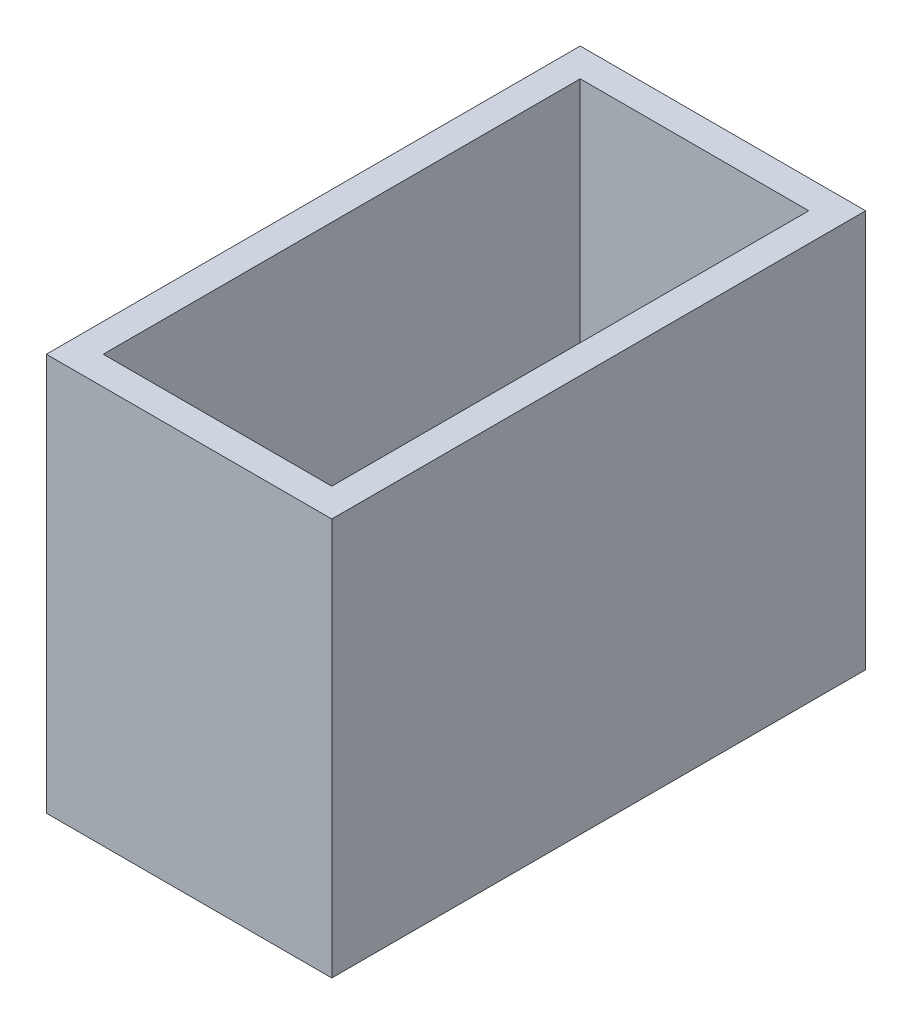
ISO-10303-21;
HEADER;
FILE_DESCRIPTION(('STEP AP214'),'2;1');
FILE_NAME('part.step','',(''),(''),'','','');
FILE_SCHEMA(('AUTOMOTIVE_DESIGN { 1 0 10303 214 1 1 1 1 }'));
ENDSEC;
DATA;
#1=APPLICATION_CONTEXT('core data for automotive mechanical design processes');
#2=APPLICATION_PROTOCOL_DEFINITION('international standard','automotive_design',2000,#1);
#3=PRODUCT_CONTEXT('',#1,'mechanical');
#4=PRODUCT('Part','Part','',(#3));
#5=PRODUCT_RELATED_PRODUCT_CATEGORY('part','',(#4));
#6=PRODUCT_DEFINITION_FORMATION('','',#4);
#7=PRODUCT_DEFINITION_CONTEXT('part definition',#1,'design');
#8=PRODUCT_DEFINITION('design','',#6,#7);
#9=PRODUCT_DEFINITION_SHAPE('','',#8);
#10=(LENGTH_UNIT() NAMED_UNIT(*) SI_UNIT(.MILLI.,.METRE.));
#11=(NAMED_UNIT(*) PLANE_ANGLE_UNIT() SI_UNIT($,.RADIAN.));
#12=(NAMED_UNIT(*) SI_UNIT($,.STERADIAN.) SOLID_ANGLE_UNIT());
#13=UNCERTAINTY_MEASURE_WITH_UNIT(LENGTH_MEASURE(1.E-05),#10,'distance_accuracy_value','');
#14=(GEOMETRIC_REPRESENTATION_CONTEXT(3) GLOBAL_UNCERTAINTY_ASSIGNED_CONTEXT((#13)) GLOBAL_UNIT_ASSIGNED_CONTEXT((#10,
#11,#12)) REPRESENTATION_CONTEXT('',''));
#15=CARTESIAN_POINT('',(0.,0.,0.));
#16=DIRECTION('',(0.,0.,1.));
#17=DIRECTION('',(1.,0.,0.));
#18=AXIS2_PLACEMENT_3D('',#15,#16,#17);
#19=CARTESIAN_POINT('',(0.,20.,0.));
#20=DIRECTION('',(0.,-1.,0.));
#21=DIRECTION('',(0.,0.,-1.));
#22=AXIS2_PLACEMENT_3D('',#19,#20,#21);
#23=PLANE('',#22);
#24=DIRECTION('',(0.,0.,1.));
#25=VECTOR('',#24,1.);
#26=CARTESIAN_POINT('',(-7.18,20.,-13.43));
#27=LINE('',#26,#25);
#28=CARTESIAN_POINT('',(-7.18,20.,-13.43));
#29=VERTEX_POINT('',#28);
#30=CARTESIAN_POINT('',(-7.18,20.,13.43));
#31=VERTEX_POINT('',#30);
#32=EDGE_CURVE('E161',#29,#31,#27,.T.);
#33=ORIENTED_EDGE('',*,*,#32,.T.);
#34=DIRECTION('',(1.,0.,0.));
#35=VECTOR('',#34,1.);
#36=CARTESIAN_POINT('',(7.18,20.,13.43));
#37=LINE('',#36,#35);
#38=CARTESIAN_POINT('',(7.18,20.,13.43));
#39=VERTEX_POINT('',#38);
#40=EDGE_CURVE('E165',#31,#39,#37,.T.);
#41=ORIENTED_EDGE('',*,*,#40,.T.);
#42=DIRECTION('',(0.,0.,-1.));
#43=VECTOR('',#42,1.);
#44=CARTESIAN_POINT('',(7.18,20.,-13.43));
#45=LINE('',#44,#43);
#46=CARTESIAN_POINT('',(7.18,20.,-13.43));
#47=VERTEX_POINT('',#46);
#48=EDGE_CURVE('E168',#39,#47,#45,.T.);
#49=ORIENTED_EDGE('',*,*,#48,.T.);
#50=DIRECTION('',(-1.,0.,0.));
#51=VECTOR('',#50,1.);
#52=CARTESIAN_POINT('',(7.18,20.,-13.43));
#53=LINE('',#52,#51);
#54=EDGE_CURVE('E171',#47,#29,#53,.T.);
#55=ORIENTED_EDGE('',*,*,#54,.T.);
#56=EDGE_LOOP('',(#33,#41,#49,#55));
#57=FACE_BOUND('',#56,.T.);
#58=DIRECTION('',(0.,0.,1.));
#59=VECTOR('',#58,1.);
#60=CARTESIAN_POINT('',(-5.75,20.,-12.));
#61=LINE('',#60,#59);
#62=CARTESIAN_POINT('',(-5.75,20.,-12.));
#63=VERTEX_POINT('',#62);
#64=CARTESIAN_POINT('',(-5.75,20.,12.));
#65=VERTEX_POINT('',#64);
#66=EDGE_CURVE('E113',#63,#65,#61,.T.);
#67=ORIENTED_EDGE('',*,*,#66,.F.);
#68=DIRECTION('',(-1.,0.,0.));
#69=VECTOR('',#68,1.);
#70=CARTESIAN_POINT('',(5.75,20.,-12.));
#71=LINE('',#70,#69);
#72=CARTESIAN_POINT('',(5.75,20.,-12.));
#73=VERTEX_POINT('',#72);
#74=EDGE_CURVE('E139',#73,#63,#71,.T.);
#75=ORIENTED_EDGE('',*,*,#74,.F.);
#76=DIRECTION('',(0.,0.,-1.));
#77=VECTOR('',#76,1.);
#78=CARTESIAN_POINT('',(5.75,20.,-12.));
#79=LINE('',#78,#77);
#80=CARTESIAN_POINT('',(5.75,20.,12.));
#81=VERTEX_POINT('',#80);
#82=EDGE_CURVE('E134',#81,#73,#79,.T.);
#83=ORIENTED_EDGE('',*,*,#82,.F.);
#84=DIRECTION('',(1.,0.,0.));
#85=VECTOR('',#84,1.);
#86=CARTESIAN_POINT('',(5.75,20.,12.));
#87=LINE('',#86,#85);
#88=EDGE_CURVE('E122',#65,#81,#87,.T.);
#89=ORIENTED_EDGE('',*,*,#88,.F.);
#90=EDGE_LOOP('',(#67,#75,#83,#89));
#91=FACE_BOUND('',#90,.T.);
#92=ADVANCED_FACE('F36',(#57,#91),#23,.F.);
#93=CARTESIAN_POINT('',(0.,0.,0.));
#94=DIRECTION('',(0.,-1.,0.));
#95=DIRECTION('',(0.,0.,-1.));
#96=AXIS2_PLACEMENT_3D('',#93,#94,#95);
#97=PLANE('',#96);
#98=DIRECTION('',(0.,0.,1.));
#99=VECTOR('',#98,1.);
#100=CARTESIAN_POINT('',(-7.18,0.,-13.43));
#101=LINE('',#100,#99);
#102=CARTESIAN_POINT('',(-7.18,0.,-13.43));
#103=VERTEX_POINT('',#102);
#104=CARTESIAN_POINT('',(-7.18,0.,13.43));
#105=VERTEX_POINT('',#104);
#106=EDGE_CURVE('E130',#103,#105,#101,.T.);
#107=ORIENTED_EDGE('',*,*,#106,.F.);
#108=DIRECTION('',(-1.,0.,0.));
#109=VECTOR('',#108,1.);
#110=CARTESIAN_POINT('',(7.18,0.,-13.43));
#111=LINE('',#110,#109);
#112=CARTESIAN_POINT('',(7.18,0.,-13.43));
#113=VERTEX_POINT('',#112);
#114=EDGE_CURVE('E166',#113,#103,#111,.T.);
#115=ORIENTED_EDGE('',*,*,#114,.F.);
#116=DIRECTION('',(0.,0.,-1.));
#117=VECTOR('',#116,1.);
#118=CARTESIAN_POINT('',(7.18,0.,-13.43));
#119=LINE('',#118,#117);
#120=CARTESIAN_POINT('',(7.18,0.,13.43));
#121=VERTEX_POINT('',#120);
#122=EDGE_CURVE('E181',#121,#113,#119,.T.);
#123=ORIENTED_EDGE('',*,*,#122,.F.);
#124=DIRECTION('',(1.,0.,0.));
#125=VECTOR('',#124,1.);
#126=CARTESIAN_POINT('',(7.18,0.,13.43));
#127=LINE('',#126,#125);
#128=EDGE_CURVE('E178',#105,#121,#127,.T.);
#129=ORIENTED_EDGE('',*,*,#128,.F.);
#130=EDGE_LOOP('',(#107,#115,#123,#129));
#131=FACE_BOUND('',#130,.T.);
#132=DIRECTION('',(-1.,0.,0.));
#133=VECTOR('',#132,1.);
#134=CARTESIAN_POINT('',(5.75,0.,-12.));
#135=LINE('',#134,#133);
#136=CARTESIAN_POINT('',(5.75,0.,-12.));
#137=VERTEX_POINT('',#136);
#138=CARTESIAN_POINT('',(-5.75,0.,-12.));
#139=VERTEX_POINT('',#138);
#140=EDGE_CURVE('E123',#137,#139,#135,.T.);
#141=ORIENTED_EDGE('',*,*,#140,.T.);
#142=DIRECTION('',(0.,0.,1.));
#143=VECTOR('',#142,1.);
#144=CARTESIAN_POINT('',(-5.75,0.,-12.));
#145=LINE('',#144,#143);
#146=CARTESIAN_POINT('',(-5.75,0.,12.));
#147=VERTEX_POINT('',#146);
#148=EDGE_CURVE('E65',#139,#147,#145,.T.);
#149=ORIENTED_EDGE('',*,*,#148,.T.);
#150=DIRECTION('',(1.,0.,0.));
#151=VECTOR('',#150,1.);
#152=CARTESIAN_POINT('',(5.75,0.,12.));
#153=LINE('',#152,#151);
#154=CARTESIAN_POINT('',(5.75,0.,12.));
#155=VERTEX_POINT('',#154);
#156=EDGE_CURVE('E129',#147,#155,#153,.T.);
#157=ORIENTED_EDGE('',*,*,#156,.T.);
#158=DIRECTION('',(0.,0.,-1.));
#159=VECTOR('',#158,1.);
#160=CARTESIAN_POINT('',(5.75,0.,-12.));
#161=LINE('',#160,#159);
#162=EDGE_CURVE('E148',#155,#137,#161,.T.);
#163=ORIENTED_EDGE('',*,*,#162,.T.);
#164=EDGE_LOOP('',(#141,#149,#157,#163));
#165=FACE_BOUND('',#164,.T.);
#166=ADVANCED_FACE('F204',(#131,#165),#97,.T.);
#167=CARTESIAN_POINT('',(-7.18,20.,-13.43));
#168=DIRECTION('',(1.,0.,0.));
#169=DIRECTION('',(0.,0.,-1.));
#170=AXIS2_PLACEMENT_3D('',#167,#168,#169);
#171=PLANE('',#170);
#172=ORIENTED_EDGE('',*,*,#106,.T.);
#173=DIRECTION('',(0.,-1.,0.));
#174=VECTOR('',#173,1.);
#175=CARTESIAN_POINT('',(-7.18,20.,13.43));
#176=LINE('',#175,#174);
#177=EDGE_CURVE('E11',#31,#105,#176,.T.);
#178=ORIENTED_EDGE('',*,*,#177,.F.);
#179=ORIENTED_EDGE('',*,*,#32,.F.);
#180=DIRECTION('',(0.,-1.,0.));
#181=VECTOR('',#180,1.);
#182=CARTESIAN_POINT('',(-7.18,20.,-13.43));
#183=LINE('',#182,#181);
#184=EDGE_CURVE('E174',#29,#103,#183,.T.);
#185=ORIENTED_EDGE('',*,*,#184,.T.);
#186=EDGE_LOOP('',(#172,#178,#179,#185));
#187=FACE_BOUND('',#186,.T.);
#188=ADVANCED_FACE('F38',(#187),#171,.F.);
#189=CARTESIAN_POINT('',(7.18,20.,13.43));
#190=DIRECTION('',(0.,0.,-1.));
#191=DIRECTION('',(-1.,0.,0.));
#192=AXIS2_PLACEMENT_3D('',#189,#190,#191);
#193=PLANE('',#192);
#194=ORIENTED_EDGE('',*,*,#128,.T.);
#195=DIRECTION('',(0.,-1.,0.));
#196=VECTOR('',#195,1.);
#197=CARTESIAN_POINT('',(7.18,20.,13.43));
#198=LINE('',#197,#196);
#199=EDGE_CURVE('E44',#39,#121,#198,.T.);
#200=ORIENTED_EDGE('',*,*,#199,.F.);
#201=ORIENTED_EDGE('',*,*,#40,.F.);
#202=ORIENTED_EDGE('',*,*,#177,.T.);
#203=EDGE_LOOP('',(#194,#200,#201,#202));
#204=FACE_BOUND('',#203,.T.);
#205=ADVANCED_FACE('F214',(#204),#193,.F.);
#206=CARTESIAN_POINT('',(7.18,20.,-13.43));
#207=DIRECTION('',(-1.,0.,0.));
#208=DIRECTION('',(0.,0.,1.));
#209=AXIS2_PLACEMENT_3D('',#206,#207,#208);
#210=PLANE('',#209);
#211=ORIENTED_EDGE('',*,*,#122,.T.);
#212=DIRECTION('',(0.,-1.,0.));
#213=VECTOR('',#212,1.);
#214=CARTESIAN_POINT('',(7.18,20.,-13.43));
#215=LINE('',#214,#213);
#216=EDGE_CURVE('E189',#47,#113,#215,.T.);
#217=ORIENTED_EDGE('',*,*,#216,.F.);
#218=ORIENTED_EDGE('',*,*,#48,.F.);
#219=ORIENTED_EDGE('',*,*,#199,.T.);
#220=EDGE_LOOP('',(#211,#217,#218,#219));
#221=FACE_BOUND('',#220,.T.);
#222=ADVANCED_FACE('F198',(#221),#210,.F.);
#223=CARTESIAN_POINT('',(7.18,20.,-13.43));
#224=DIRECTION('',(0.,0.,1.));
#225=DIRECTION('',(1.,0.,0.));
#226=AXIS2_PLACEMENT_3D('',#223,#224,#225);
#227=PLANE('',#226);
#228=ORIENTED_EDGE('',*,*,#114,.T.);
#229=ORIENTED_EDGE('',*,*,#184,.F.);
#230=ORIENTED_EDGE('',*,*,#54,.F.);
#231=ORIENTED_EDGE('',*,*,#216,.T.);
#232=EDGE_LOOP('',(#228,#229,#230,#231));
#233=FACE_BOUND('',#232,.T.);
#234=ADVANCED_FACE('F208',(#233),#227,.F.);
#235=CARTESIAN_POINT('',(-5.75,20.,-12.));
#236=DIRECTION('',(1.,0.,0.));
#237=DIRECTION('',(0.,0.,-1.));
#238=AXIS2_PLACEMENT_3D('',#235,#236,#237);
#239=PLANE('',#238);
#240=ORIENTED_EDGE('',*,*,#148,.F.);
#241=DIRECTION('',(0.,-1.,0.));
#242=VECTOR('',#241,1.);
#243=CARTESIAN_POINT('',(-5.75,20.,-12.));
#244=LINE('',#243,#242);
#245=EDGE_CURVE('E117',#63,#139,#244,.T.);
#246=ORIENTED_EDGE('',*,*,#245,.F.);
#247=ORIENTED_EDGE('',*,*,#66,.T.);
#248=DIRECTION('',(0.,-1.,0.));
#249=VECTOR('',#248,1.);
#250=CARTESIAN_POINT('',(-5.75,20.,12.));
#251=LINE('',#250,#249);
#252=EDGE_CURVE('E116',#65,#147,#251,.T.);
#253=ORIENTED_EDGE('',*,*,#252,.T.);
#254=EDGE_LOOP('',(#240,#246,#247,#253));
#255=FACE_BOUND('',#254,.T.);
#256=ADVANCED_FACE('F115',(#255),#239,.T.);
#257=CARTESIAN_POINT('',(5.75,20.,12.));
#258=DIRECTION('',(0.,0.,-1.));
#259=DIRECTION('',(-1.,0.,0.));
#260=AXIS2_PLACEMENT_3D('',#257,#258,#259);
#261=PLANE('',#260);
#262=ORIENTED_EDGE('',*,*,#156,.F.);
#263=ORIENTED_EDGE('',*,*,#252,.F.);
#264=ORIENTED_EDGE('',*,*,#88,.T.);
#265=DIRECTION('',(0.,-1.,0.));
#266=VECTOR('',#265,1.);
#267=CARTESIAN_POINT('',(5.75,20.,12.));
#268=LINE('',#267,#266);
#269=EDGE_CURVE('E131',#81,#155,#268,.T.);
#270=ORIENTED_EDGE('',*,*,#269,.T.);
#271=EDGE_LOOP('',(#262,#263,#264,#270));
#272=FACE_BOUND('',#271,.T.);
#273=ADVANCED_FACE('F126',(#272),#261,.T.);
#274=CARTESIAN_POINT('',(5.75,20.,-12.));
#275=DIRECTION('',(-1.,0.,0.));
#276=DIRECTION('',(0.,0.,1.));
#277=AXIS2_PLACEMENT_3D('',#274,#275,#276);
#278=PLANE('',#277);
#279=ORIENTED_EDGE('',*,*,#162,.F.);
#280=ORIENTED_EDGE('',*,*,#269,.F.);
#281=ORIENTED_EDGE('',*,*,#82,.T.);
#282=DIRECTION('',(0.,-1.,0.));
#283=VECTOR('',#282,1.);
#284=CARTESIAN_POINT('',(5.75,20.,-12.));
#285=LINE('',#284,#283);
#286=EDGE_CURVE('E54',#73,#137,#285,.T.);
#287=ORIENTED_EDGE('',*,*,#286,.T.);
#288=EDGE_LOOP('',(#279,#280,#281,#287));
#289=FACE_BOUND('',#288,.T.);
#290=ADVANCED_FACE('F237',(#289),#278,.T.);
#291=CARTESIAN_POINT('',(5.75,20.,-12.));
#292=DIRECTION('',(0.,0.,1.));
#293=DIRECTION('',(1.,0.,0.));
#294=AXIS2_PLACEMENT_3D('',#291,#292,#293);
#295=PLANE('',#294);
#296=ORIENTED_EDGE('',*,*,#140,.F.);
#297=ORIENTED_EDGE('',*,*,#286,.F.);
#298=ORIENTED_EDGE('',*,*,#74,.T.);
#299=ORIENTED_EDGE('',*,*,#245,.T.);
#300=EDGE_LOOP('',(#296,#297,#298,#299));
#301=FACE_BOUND('',#300,.T.);
#302=ADVANCED_FACE('F241',(#301),#295,.T.);
#303=CLOSED_SHELL('',(#92,#166,#188,#205,#222,#234,#256,#273,#290,#302));
#304=MANIFOLD_SOLID_BREP('B2',#303);
#305=ADVANCED_BREP_SHAPE_REPRESENTATION('',(#18,#304),#14);
#306=SHAPE_DEFINITION_REPRESENTATION(#9,#305);
ENDSEC;
END-ISO-10303-21;
